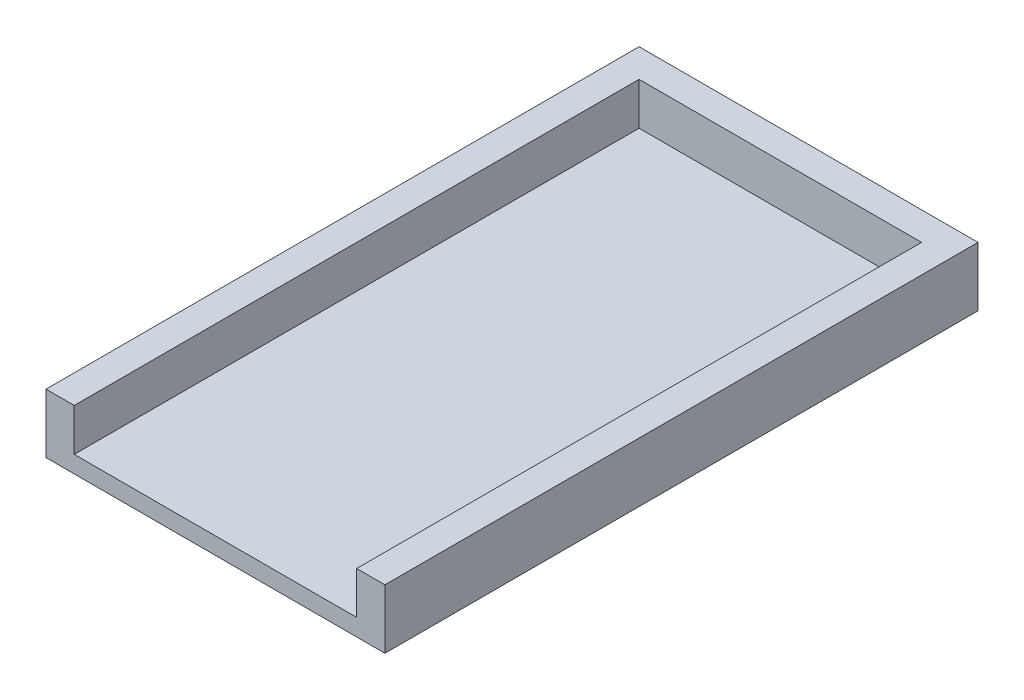
ISO-10303-21;
HEADER;
FILE_DESCRIPTION(('STEP AP214'),'2;1');
FILE_NAME('part.step','',(''),(''),'','','');
FILE_SCHEMA(('AUTOMOTIVE_DESIGN { 1 0 10303 214 1 1 1 1 }'));
ENDSEC;
DATA;
#1=APPLICATION_CONTEXT('core data for automotive mechanical design processes');
#2=APPLICATION_PROTOCOL_DEFINITION('international standard','automotive_design',2000,#1);
#3=PRODUCT_CONTEXT('',#1,'mechanical');
#4=PRODUCT('Part','Part','',(#3));
#5=PRODUCT_RELATED_PRODUCT_CATEGORY('part','',(#4));
#6=PRODUCT_DEFINITION_FORMATION('','',#4);
#7=PRODUCT_DEFINITION_CONTEXT('part definition',#1,'design');
#8=PRODUCT_DEFINITION('design','',#6,#7);
#9=PRODUCT_DEFINITION_SHAPE('','',#8);
#10=(LENGTH_UNIT() NAMED_UNIT(*) SI_UNIT(.MILLI.,.METRE.));
#11=(NAMED_UNIT(*) PLANE_ANGLE_UNIT() SI_UNIT($,.RADIAN.));
#12=(NAMED_UNIT(*) SI_UNIT($,.STERADIAN.) SOLID_ANGLE_UNIT());
#13=UNCERTAINTY_MEASURE_WITH_UNIT(LENGTH_MEASURE(1.E-05),#10,'distance_accuracy_value','');
#14=(GEOMETRIC_REPRESENTATION_CONTEXT(3) GLOBAL_UNCERTAINTY_ASSIGNED_CONTEXT((#13)) GLOBAL_UNIT_ASSIGNED_CONTEXT((#10,
#11,#12)) REPRESENTATION_CONTEXT('',''));
#15=CARTESIAN_POINT('',(0.,0.,0.));
#16=DIRECTION('',(0.,0.,1.));
#17=DIRECTION('',(1.,0.,0.));
#18=AXIS2_PLACEMENT_3D('',#15,#16,#17);
#19=CARTESIAN_POINT('',(0.,19.05,0.));
#20=DIRECTION('',(0.,-1.,0.));
#21=DIRECTION('',(0.,0.,-1.));
#22=AXIS2_PLACEMENT_3D('',#19,#20,#21);
#23=PLANE('',#22);
#24=DIRECTION('',(0.,0.,1.));
#25=VECTOR('',#24,1.);
#26=CARTESIAN_POINT('',(0.,19.05,0.));
#27=LINE('',#26,#25);
#28=CARTESIAN_POINT('',(0.,19.05,-254.));
#29=VERTEX_POINT('',#28);
#30=CARTESIAN_POINT('',(0.,19.05,0.));
#31=VERTEX_POINT('',#30);
#32=EDGE_CURVE('E137',#29,#31,#27,.T.);
#33=ORIENTED_EDGE('',*,*,#32,.F.);
#34=DIRECTION('',(-1.,0.,0.));
#35=VECTOR('',#34,1.);
#36=CARTESIAN_POINT('',(0.,19.05,-254.));
#37=LINE('',#36,#35);
#38=CARTESIAN_POINT('',(127.,19.05,-254.));
#39=VERTEX_POINT('',#38);
#40=EDGE_CURVE('E133',#39,#29,#37,.T.);
#41=ORIENTED_EDGE('',*,*,#40,.F.);
#42=DIRECTION('',(0.,0.,-1.));
#43=VECTOR('',#42,1.);
#44=CARTESIAN_POINT('',(127.,19.05,0.));
#45=LINE('',#44,#43);
#46=CARTESIAN_POINT('',(127.,19.05,0.));
#47=VERTEX_POINT('',#46);
#48=EDGE_CURVE('E148',#47,#39,#45,.T.);
#49=ORIENTED_EDGE('',*,*,#48,.F.);
#50=DIRECTION('',(1.,0.,0.));
#51=VECTOR('',#50,1.);
#52=CARTESIAN_POINT('',(0.,19.05,0.));
#53=LINE('',#52,#51);
#54=CARTESIAN_POINT('',(139.7,19.05,0.));
#55=VERTEX_POINT('',#54);
#56=EDGE_CURVE('E123',#47,#55,#53,.T.);
#57=ORIENTED_EDGE('',*,*,#56,.T.);
#58=DIRECTION('',(0.,0.,-1.));
#59=VECTOR('',#58,1.);
#60=CARTESIAN_POINT('',(139.7,19.05,0.));
#61=LINE('',#60,#59);
#62=CARTESIAN_POINT('',(139.7,19.05,-266.7));
#63=VERTEX_POINT('',#62);
#64=EDGE_CURVE('E108',#55,#63,#61,.T.);
#65=ORIENTED_EDGE('',*,*,#64,.T.);
#66=DIRECTION('',(-1.,0.,0.));
#67=VECTOR('',#66,1.);
#68=CARTESIAN_POINT('',(0.,19.05,-266.7));
#69=LINE('',#68,#67);
#70=CARTESIAN_POINT('',(-12.7000000000001,19.05,-266.7));
#71=VERTEX_POINT('',#70);
#72=EDGE_CURVE('E58',#63,#71,#69,.T.);
#73=ORIENTED_EDGE('',*,*,#72,.T.);
#74=DIRECTION('',(0.,0.,1.));
#75=VECTOR('',#74,1.);
#76=CARTESIAN_POINT('',(-12.7,19.05,0.));
#77=LINE('',#76,#75);
#78=CARTESIAN_POINT('',(-12.7,19.05,0.));
#79=VERTEX_POINT('',#78);
#80=EDGE_CURVE('E36',#71,#79,#77,.T.);
#81=ORIENTED_EDGE('',*,*,#80,.T.);
#82=EDGE_CURVE('E69',#79,#31,#53,.T.);
#83=ORIENTED_EDGE('',*,*,#82,.T.);
#84=EDGE_LOOP('',(#33,#41,#49,#57,#65,#73,#81,#83));
#85=FACE_BOUND('',#84,.T.);
#86=ADVANCED_FACE('F32',(#85),#23,.F.);
#87=CARTESIAN_POINT('',(-12.7,19.05,0.));
#88=DIRECTION('',(1.,0.,0.));
#89=DIRECTION('',(0.,0.,-1.));
#90=AXIS2_PLACEMENT_3D('',#87,#88,#89);
#91=PLANE('',#90);
#92=DIRECTION('',(0.,0.,1.));
#93=VECTOR('',#92,1.);
#94=CARTESIAN_POINT('',(-12.7,-7.62,0.));
#95=LINE('',#94,#93);
#96=CARTESIAN_POINT('',(-12.7000000000001,-7.62,-266.7));
#97=VERTEX_POINT('',#96);
#98=CARTESIAN_POINT('',(-12.7,-7.62,0.));
#99=VERTEX_POINT('',#98);
#100=EDGE_CURVE('E103',#97,#99,#95,.T.);
#101=ORIENTED_EDGE('',*,*,#100,.T.);
#102=DIRECTION('',(0.,-1.,0.));
#103=VECTOR('',#102,1.);
#104=CARTESIAN_POINT('',(-12.7,19.05,0.));
#105=LINE('',#104,#103);
#106=EDGE_CURVE('E11',#79,#99,#105,.T.);
#107=ORIENTED_EDGE('',*,*,#106,.F.);
#108=ORIENTED_EDGE('',*,*,#80,.F.);
#109=DIRECTION('',(0.,-1.,0.));
#110=VECTOR('',#109,1.);
#111=CARTESIAN_POINT('',(-12.7000000000001,19.05,-266.7));
#112=LINE('',#111,#110);
#113=EDGE_CURVE('E115',#71,#97,#112,.T.);
#114=ORIENTED_EDGE('',*,*,#113,.T.);
#115=EDGE_LOOP('',(#101,#107,#108,#114));
#116=FACE_BOUND('',#115,.T.);
#117=ADVANCED_FACE('F162',(#116),#91,.F.);
#118=CARTESIAN_POINT('',(0.,19.05,0.));
#119=DIRECTION('',(0.,0.,-1.));
#120=DIRECTION('',(-1.,0.,0.));
#121=AXIS2_PLACEMENT_3D('',#118,#119,#120);
#122=PLANE('',#121);
#123=ORIENTED_EDGE('',*,*,#56,.F.);
#124=DIRECTION('',(0.,-1.,0.));
#125=VECTOR('',#124,1.);
#126=CARTESIAN_POINT('',(127.,19.05,0.));
#127=LINE('',#126,#125);
#128=CARTESIAN_POINT('',(127.,0.,0.));
#129=VERTEX_POINT('',#128);
#130=EDGE_CURVE('E126',#47,#129,#127,.T.);
#131=ORIENTED_EDGE('',*,*,#130,.T.);
#132=DIRECTION('',(1.,0.,0.));
#133=VECTOR('',#132,1.);
#134=CARTESIAN_POINT('',(0.,0.,0.));
#135=LINE('',#134,#133);
#136=CARTESIAN_POINT('',(0.,0.,0.));
#137=VERTEX_POINT('',#136);
#138=EDGE_CURVE('E141',#137,#129,#135,.T.);
#139=ORIENTED_EDGE('',*,*,#138,.F.);
#140=DIRECTION('',(0.,-1.,0.));
#141=VECTOR('',#140,1.);
#142=CARTESIAN_POINT('',(0.,19.05,0.));
#143=LINE('',#142,#141);
#144=EDGE_CURVE('E121',#31,#137,#143,.T.);
#145=ORIENTED_EDGE('',*,*,#144,.F.);
#146=ORIENTED_EDGE('',*,*,#82,.F.);
#147=ORIENTED_EDGE('',*,*,#106,.T.);
#148=DIRECTION('',(1.,0.,0.));
#149=VECTOR('',#148,1.);
#150=CARTESIAN_POINT('',(0.,-7.62,0.));
#151=LINE('',#150,#149);
#152=CARTESIAN_POINT('',(139.7,-7.62,0.));
#153=VERTEX_POINT('',#152);
#154=EDGE_CURVE('E92',#99,#153,#151,.T.);
#155=ORIENTED_EDGE('',*,*,#154,.T.);
#156=DIRECTION('',(0.,-1.,0.));
#157=VECTOR('',#156,1.);
#158=CARTESIAN_POINT('',(139.7,19.05,0.));
#159=LINE('',#158,#157);
#160=EDGE_CURVE('E41',#55,#153,#159,.T.);
#161=ORIENTED_EDGE('',*,*,#160,.F.);
#162=EDGE_LOOP('',(#123,#131,#139,#145,#146,#147,#155,#161));
#163=FACE_BOUND('',#162,.T.);
#164=ADVANCED_FACE('F95',(#163),#122,.F.);
#165=CARTESIAN_POINT('',(139.7,19.05,0.));
#166=DIRECTION('',(-1.,0.,0.));
#167=DIRECTION('',(0.,0.,1.));
#168=AXIS2_PLACEMENT_3D('',#165,#166,#167);
#169=PLANE('',#168);
#170=DIRECTION('',(0.,0.,-1.));
#171=VECTOR('',#170,1.);
#172=CARTESIAN_POINT('',(139.7,-7.62,0.));
#173=LINE('',#172,#171);
#174=CARTESIAN_POINT('',(139.7,-7.62,-266.7));
#175=VERTEX_POINT('',#174);
#176=EDGE_CURVE('E102',#153,#175,#173,.T.);
#177=ORIENTED_EDGE('',*,*,#176,.T.);
#178=DIRECTION('',(0.,-1.,0.));
#179=VECTOR('',#178,1.);
#180=CARTESIAN_POINT('',(139.7,19.05,-266.7));
#181=LINE('',#180,#179);
#182=EDGE_CURVE('E109',#63,#175,#181,.T.);
#183=ORIENTED_EDGE('',*,*,#182,.F.);
#184=ORIENTED_EDGE('',*,*,#64,.F.);
#185=ORIENTED_EDGE('',*,*,#160,.T.);
#186=EDGE_LOOP('',(#177,#183,#184,#185));
#187=FACE_BOUND('',#186,.T.);
#188=ADVANCED_FACE('F106',(#187),#169,.F.);
#189=CARTESIAN_POINT('',(0.,19.05,-266.7));
#190=DIRECTION('',(0.,0.,1.));
#191=DIRECTION('',(1.,0.,0.));
#192=AXIS2_PLACEMENT_3D('',#189,#190,#191);
#193=PLANE('',#192);
#194=DIRECTION('',(-1.,0.,0.));
#195=VECTOR('',#194,1.);
#196=CARTESIAN_POINT('',(0.,-7.62,-266.7));
#197=LINE('',#196,#195);
#198=EDGE_CURVE('E77',#175,#97,#197,.T.);
#199=ORIENTED_EDGE('',*,*,#198,.T.);
#200=ORIENTED_EDGE('',*,*,#113,.F.);
#201=ORIENTED_EDGE('',*,*,#72,.F.);
#202=ORIENTED_EDGE('',*,*,#182,.T.);
#203=EDGE_LOOP('',(#199,#200,#201,#202));
#204=FACE_BOUND('',#203,.T.);
#205=ADVANCED_FACE('F173',(#204),#193,.F.);
#206=CARTESIAN_POINT('',(0.,-7.62,0.));
#207=DIRECTION('',(0.,-1.,0.));
#208=DIRECTION('',(0.,0.,-1.));
#209=AXIS2_PLACEMENT_3D('',#206,#207,#208);
#210=PLANE('',#209);
#211=ORIENTED_EDGE('',*,*,#100,.F.);
#212=ORIENTED_EDGE('',*,*,#198,.F.);
#213=ORIENTED_EDGE('',*,*,#176,.F.);
#214=ORIENTED_EDGE('',*,*,#154,.F.);
#215=EDGE_LOOP('',(#211,#212,#213,#214));
#216=FACE_BOUND('',#215,.T.);
#217=ADVANCED_FACE('F34',(#216),#210,.T.);
#218=CARTESIAN_POINT('',(0.,19.05,0.));
#219=DIRECTION('',(1.,0.,0.));
#220=DIRECTION('',(0.,0.,-1.));
#221=AXIS2_PLACEMENT_3D('',#218,#219,#220);
#222=PLANE('',#221);
#223=DIRECTION('',(0.,0.,1.));
#224=VECTOR('',#223,1.);
#225=CARTESIAN_POINT('',(0.,0.,0.));
#226=LINE('',#225,#224);
#227=CARTESIAN_POINT('',(0.,0.,-254.));
#228=VERTEX_POINT('',#227);
#229=EDGE_CURVE('E144',#228,#137,#226,.T.);
#230=ORIENTED_EDGE('',*,*,#229,.F.);
#231=DIRECTION('',(0.,-1.,0.));
#232=VECTOR('',#231,1.);
#233=CARTESIAN_POINT('',(0.,19.05,-254.));
#234=LINE('',#233,#232);
#235=EDGE_CURVE('E130',#29,#228,#234,.T.);
#236=ORIENTED_EDGE('',*,*,#235,.F.);
#237=ORIENTED_EDGE('',*,*,#32,.T.);
#238=ORIENTED_EDGE('',*,*,#144,.T.);
#239=EDGE_LOOP('',(#230,#236,#237,#238));
#240=FACE_BOUND('',#239,.T.);
#241=ADVANCED_FACE('F156',(#240),#222,.T.);
#242=CARTESIAN_POINT('',(127.,19.05,0.));
#243=DIRECTION('',(-1.,0.,0.));
#244=DIRECTION('',(0.,0.,1.));
#245=AXIS2_PLACEMENT_3D('',#242,#243,#244);
#246=PLANE('',#245);
#247=DIRECTION('',(0.,0.,-1.));
#248=VECTOR('',#247,1.);
#249=CARTESIAN_POINT('',(127.,0.,0.));
#250=LINE('',#249,#248);
#251=CARTESIAN_POINT('',(127.,0.,-254.));
#252=VERTEX_POINT('',#251);
#253=EDGE_CURVE('E138',#129,#252,#250,.T.);
#254=ORIENTED_EDGE('',*,*,#253,.F.);
#255=ORIENTED_EDGE('',*,*,#130,.F.);
#256=ORIENTED_EDGE('',*,*,#48,.T.);
#257=DIRECTION('',(0.,-1.,0.));
#258=VECTOR('',#257,1.);
#259=CARTESIAN_POINT('',(127.,19.05,-254.));
#260=LINE('',#259,#258);
#261=EDGE_CURVE('E49',#39,#252,#260,.T.);
#262=ORIENTED_EDGE('',*,*,#261,.T.);
#263=EDGE_LOOP('',(#254,#255,#256,#262));
#264=FACE_BOUND('',#263,.T.);
#265=ADVANCED_FACE('F181',(#264),#246,.T.);
#266=CARTESIAN_POINT('',(0.,19.05,-254.));
#267=DIRECTION('',(0.,0.,1.));
#268=DIRECTION('',(1.,0.,0.));
#269=AXIS2_PLACEMENT_3D('',#266,#267,#268);
#270=PLANE('',#269);
#271=DIRECTION('',(-1.,0.,0.));
#272=VECTOR('',#271,1.);
#273=CARTESIAN_POINT('',(0.,0.,-254.));
#274=LINE('',#273,#272);
#275=EDGE_CURVE('E134',#252,#228,#274,.T.);
#276=ORIENTED_EDGE('',*,*,#275,.F.);
#277=ORIENTED_EDGE('',*,*,#261,.F.);
#278=ORIENTED_EDGE('',*,*,#40,.T.);
#279=ORIENTED_EDGE('',*,*,#235,.T.);
#280=EDGE_LOOP('',(#276,#277,#278,#279));
#281=FACE_BOUND('',#280,.T.);
#282=ADVANCED_FACE('F186',(#281),#270,.T.);
#283=CARTESIAN_POINT('',(0.,0.,0.));
#284=DIRECTION('',(0.,-1.,0.));
#285=DIRECTION('',(0.,0.,-1.));
#286=AXIS2_PLACEMENT_3D('',#283,#284,#285);
#287=PLANE('',#286);
#288=ORIENTED_EDGE('',*,*,#229,.T.);
#289=ORIENTED_EDGE('',*,*,#138,.T.);
#290=ORIENTED_EDGE('',*,*,#253,.T.);
#291=ORIENTED_EDGE('',*,*,#275,.T.);
#292=EDGE_LOOP('',(#288,#289,#290,#291));
#293=FACE_BOUND('',#292,.T.);
#294=ADVANCED_FACE('F192',(#293),#287,.F.);
#295=CLOSED_SHELL('',(#86,#117,#164,#188,#205,#217,#241,#265,#282,#294));
#296=MANIFOLD_SOLID_BREP('B2',#295);
#297=ADVANCED_BREP_SHAPE_REPRESENTATION('',(#18,#296),#14);
#298=SHAPE_DEFINITION_REPRESENTATION(#9,#297);
ENDSEC;
END-ISO-10303-21;
